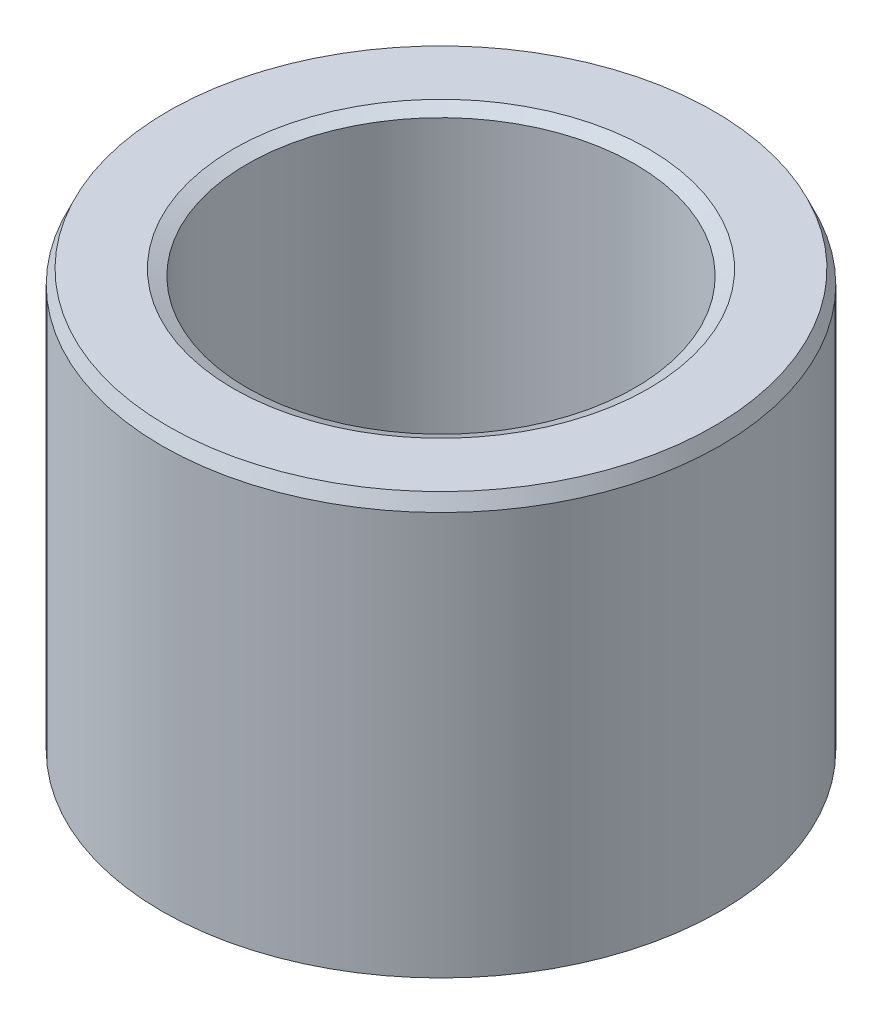
ISO-10303-21;
HEADER;
FILE_DESCRIPTION(('STEP AP214'),'2;1');
FILE_NAME('part.step','',(''),(''),'','','');
FILE_SCHEMA(('AUTOMOTIVE_DESIGN { 1 0 10303 214 1 1 1 1 }'));
ENDSEC;
DATA;
#1=APPLICATION_CONTEXT('core data for automotive mechanical design processes');
#2=APPLICATION_PROTOCOL_DEFINITION('international standard','automotive_design',2000,#1);
#3=PRODUCT_CONTEXT('',#1,'mechanical');
#4=PRODUCT('Part','Part','',(#3));
#5=PRODUCT_RELATED_PRODUCT_CATEGORY('part','',(#4));
#6=PRODUCT_DEFINITION_FORMATION('','',#4);
#7=PRODUCT_DEFINITION_CONTEXT('part definition',#1,'design');
#8=PRODUCT_DEFINITION('design','',#6,#7);
#9=PRODUCT_DEFINITION_SHAPE('','',#8);
#10=(LENGTH_UNIT() NAMED_UNIT(*) SI_UNIT(.MILLI.,.METRE.));
#11=(NAMED_UNIT(*) PLANE_ANGLE_UNIT() SI_UNIT($,.RADIAN.));
#12=(NAMED_UNIT(*) SI_UNIT($,.STERADIAN.) SOLID_ANGLE_UNIT());
#13=UNCERTAINTY_MEASURE_WITH_UNIT(LENGTH_MEASURE(1.E-05),#10,'distance_accuracy_value','');
#14=(GEOMETRIC_REPRESENTATION_CONTEXT(3) GLOBAL_UNCERTAINTY_ASSIGNED_CONTEXT((#13)) GLOBAL_UNIT_ASSIGNED_CONTEXT((#10,
#11,#12)) REPRESENTATION_CONTEXT('',''));
#15=CARTESIAN_POINT('',(0.,0.,0.));
#16=DIRECTION('',(0.,0.,1.));
#17=DIRECTION('',(1.,0.,0.));
#18=AXIS2_PLACEMENT_3D('',#15,#16,#17);
#19=CARTESIAN_POINT('',(0.,15.1544612259986,0.));
#20=DIRECTION('',(0.,-1.,0.));
#21=DIRECTION('',(0.,0.,-1.));
#22=AXIS2_PLACEMENT_3D('',#19,#20,#21);
#23=CYLINDRICAL_SURFACE('',#22,10.);
#24=CARTESIAN_POINT('',(0.,0.223008602792184,0.));
#25=DIRECTION('',(0.,1.,0.));
#26=DIRECTION('',(0.,0.,1.));
#27=AXIS2_PLACEMENT_3D('',#24,#25,#26);
#28=CIRCLE('',#27,10.);
#29=CARTESIAN_POINT('',(0.,0.223008602792184,10.));
#30=VERTEX_POINT('',#29);
#31=EDGE_CURVE('E10',#30,#30,#28,.T.);
#32=ORIENTED_EDGE('',*,*,#31,.T.);
#33=EDGE_LOOP('',(#32));
#34=FACE_BOUND('',#33,.T.);
#35=CARTESIAN_POINT('',(0.,14.6619157834008,0.));
#36=DIRECTION('',(0.,1.,0.));
#37=DIRECTION('',(0.,0.,1.));
#38=AXIS2_PLACEMENT_3D('',#35,#36,#37);
#39=CIRCLE('',#38,10.);
#40=CARTESIAN_POINT('',(0.,14.6619157834008,10.));
#41=VERTEX_POINT('',#40);
#42=EDGE_CURVE('E50',#41,#41,#39,.F.);
#43=ORIENTED_EDGE('',*,*,#42,.T.);
#44=EDGE_LOOP('',(#43));
#45=FACE_BOUND('',#44,.T.);
#46=ADVANCED_FACE('F39',(#34,#45),#23,.T.);
#47=CARTESIAN_POINT('',(0.,15.1544612259986,0.));
#48=DIRECTION('',(0.,1.,0.));
#49=DIRECTION('',(0.,0.,1.));
#50=AXIS2_PLACEMENT_3D('',#47,#48,#49);
#51=PLANE('',#50);
#52=CARTESIAN_POINT('',(0.,15.1544612259986,0.));
#53=DIRECTION('',(0.,1.,0.));
#54=DIRECTION('',(0.,0.,1.));
#55=AXIS2_PLACEMENT_3D('',#52,#53,#54);
#56=CIRCLE('',#55,7.43730472030932);
#57=CARTESIAN_POINT('',(0.,15.1544612259986,7.43730472030932));
#58=VERTEX_POINT('',#57);
#59=EDGE_CURVE('E58',#58,#58,#56,.F.);
#60=ORIENTED_EDGE('',*,*,#59,.T.);
#61=EDGE_LOOP('',(#60));
#62=FACE_BOUND('',#61,.T.);
#63=CARTESIAN_POINT('',(0.,15.1544612259986,0.));
#64=DIRECTION('',(0.,1.,0.));
#65=DIRECTION('',(0.,0.,1.));
#66=AXIS2_PLACEMENT_3D('',#63,#64,#65);
#67=CIRCLE('',#66,9.77699139720781);
#68=CARTESIAN_POINT('',(0.,15.1544612259986,9.77699139720781));
#69=VERTEX_POINT('',#68);
#70=EDGE_CURVE('E61',#69,#69,#67,.T.);
#71=ORIENTED_EDGE('',*,*,#70,.T.);
#72=EDGE_LOOP('',(#71));
#73=FACE_BOUND('',#72,.T.);
#74=ADVANCED_FACE('F88',(#62,#73),#51,.T.);
#75=CARTESIAN_POINT('',(0.,0.,0.));
#76=DIRECTION('',(0.,1.,0.));
#77=DIRECTION('',(0.,0.,1.));
#78=AXIS2_PLACEMENT_3D('',#75,#76,#77);
#79=PLANE('',#78);
#80=CARTESIAN_POINT('',(0.,0.,0.));
#81=DIRECTION('',(0.,1.,0.));
#82=DIRECTION('',(0.,0.,1.));
#83=AXIS2_PLACEMENT_3D('',#80,#81,#82);
#84=CIRCLE('',#83,7.16776788050371);
#85=CARTESIAN_POINT('',(0.,0.,7.16776788050371));
#86=VERTEX_POINT('',#85);
#87=EDGE_CURVE('E51',#86,#86,#84,.T.);
#88=ORIENTED_EDGE('',*,*,#87,.T.);
#89=EDGE_LOOP('',(#88));
#90=FACE_BOUND('',#89,.T.);
#91=CARTESIAN_POINT('',(0.,0.,0.));
#92=DIRECTION('',(0.,1.,0.));
#93=DIRECTION('',(0.,0.,1.));
#94=AXIS2_PLACEMENT_3D('',#91,#92,#93);
#95=CIRCLE('',#94,9.5074545574022);
#96=CARTESIAN_POINT('',(0.,0.,9.5074545574022));
#97=VERTEX_POINT('',#96);
#98=EDGE_CURVE('E54',#97,#97,#95,.F.);
#99=ORIENTED_EDGE('',*,*,#98,.T.);
#100=EDGE_LOOP('',(#99));
#101=FACE_BOUND('',#100,.T.);
#102=ADVANCED_FACE('F83',(#90,#101),#79,.F.);
#103=CARTESIAN_POINT('',(0.,15.1544612259986,0.));
#104=DIRECTION('',(0.,-1.,0.));
#105=DIRECTION('',(0.,0.,-1.));
#106=AXIS2_PLACEMENT_3D('',#103,#104,#105);
#107=CYLINDRICAL_SURFACE('',#106,6.94475927771152);
#108=CARTESIAN_POINT('',(0.,14.9314526232064,0.));
#109=DIRECTION('',(0.,1.,0.));
#110=DIRECTION('',(0.,0.,1.));
#111=AXIS2_PLACEMENT_3D('',#108,#109,#110);
#112=CIRCLE('',#111,6.94475927771152);
#113=CARTESIAN_POINT('',(0.,14.9314526232064,6.94475927771152));
#114=VERTEX_POINT('',#113);
#115=EDGE_CURVE('E67',#114,#114,#112,.T.);
#116=ORIENTED_EDGE('',*,*,#115,.T.);
#117=EDGE_LOOP('',(#116));
#118=FACE_BOUND('',#117,.T.);
#119=CARTESIAN_POINT('',(0.,0.492545442597801,0.));
#120=DIRECTION('',(0.,1.,0.));
#121=DIRECTION('',(0.,0.,1.));
#122=AXIS2_PLACEMENT_3D('',#119,#120,#121);
#123=CIRCLE('',#122,6.94475927771152);
#124=CARTESIAN_POINT('',(0.,0.492545442597801,6.94475927771152));
#125=VERTEX_POINT('',#124);
#126=EDGE_CURVE('E69',#125,#125,#123,.F.);
#127=ORIENTED_EDGE('',*,*,#126,.T.);
#128=EDGE_LOOP('',(#127));
#129=FACE_BOUND('',#128,.T.);
#130=ADVANCED_FACE('F71',(#118,#129),#107,.F.);
#131=CARTESIAN_POINT('',(0.,14.9314526232064,0.));
#132=DIRECTION('',(0.,1.,0.));
#133=DIRECTION('',(0.,0.,1.));
#134=AXIS2_PLACEMENT_3D('',#131,#132,#133);
#135=CONICAL_SURFACE('',#134,6.94475927771152,1.1456432729864);
#136=ORIENTED_EDGE('',*,*,#59,.F.);
#137=EDGE_LOOP('',(#136));
#138=FACE_BOUND('',#137,.T.);
#139=ORIENTED_EDGE('',*,*,#115,.F.);
#140=EDGE_LOOP('',(#139));
#141=FACE_BOUND('',#140,.T.);
#142=ADVANCED_FACE('F77',(#138,#141),#135,.F.);
#143=CARTESIAN_POINT('',(0.,0.,0.));
#144=DIRECTION('',(0.,-1.,0.));
#145=DIRECTION('',(0.,0.,-1.));
#146=AXIS2_PLACEMENT_3D('',#143,#144,#145);
#147=CONICAL_SURFACE('',#146,7.16776788050371,0.425153053808501);
#148=ORIENTED_EDGE('',*,*,#126,.F.);
#149=EDGE_LOOP('',(#148));
#150=FACE_BOUND('',#149,.T.);
#151=ORIENTED_EDGE('',*,*,#87,.F.);
#152=EDGE_LOOP('',(#151));
#153=FACE_BOUND('',#152,.T.);
#154=ADVANCED_FACE('F73',(#150,#153),#147,.F.);
#155=CARTESIAN_POINT('',(0.,0.223008602792184,0.));
#156=DIRECTION('',(0.,1.,0.));
#157=DIRECTION('',(0.,0.,1.));
#158=AXIS2_PLACEMENT_3D('',#155,#156,#157);
#159=CONICAL_SURFACE('',#158,10.,1.1456432729864);
#160=CARTESIAN_POINT('',(0.,0.,9.5074545574022));
#161=CARTESIAN_POINT('',(0.,0.00232300627908523,9.51258523909593));
#162=CARTESIAN_POINT('',(0.,0.00464601255817048,9.51771592078965));
#163=CARTESIAN_POINT('',(0.,0.00929202511634099,9.52797728417711));
#164=CARTESIAN_POINT('',(0.,0.0116150313954262,9.53310796587084));
#165=CARTESIAN_POINT('',(0.,0.0162610439535968,9.54336932925829));
#166=CARTESIAN_POINT('',(0.,0.018584050232682,9.54850001095202));
#167=CARTESIAN_POINT('',(0.,0.0232300627908525,9.55876137433947));
#168=CARTESIAN_POINT('',(0.,0.0255530690699378,9.5638920560332));
#169=CARTESIAN_POINT('',(0.,0.0301990816281083,9.57415341942065));
#170=CARTESIAN_POINT('',(0.,0.0325220879071935,9.57928410111438));
#171=CARTESIAN_POINT('',(0.,0.037168100465364,9.58954546450183));
#172=CARTESIAN_POINT('',(0.,0.0394911067444493,9.59467614619556));
#173=CARTESIAN_POINT('',(0.,0.0441371193026198,9.60493750958301));
#174=CARTESIAN_POINT('',(0.,0.0464601255817051,9.61006819127674));
#175=CARTESIAN_POINT('',(0.,0.0511061381398756,9.6203295546642));
#176=CARTESIAN_POINT('',(0.,0.0534291444189608,9.62546023635792));
#177=CARTESIAN_POINT('',(0.,0.0580751569771313,9.63572159974538));
#178=CARTESIAN_POINT('',(0.,0.0603981632562166,9.64085228143911));
#179=CARTESIAN_POINT('',(0.,0.0650441758143871,9.65111364482656));
#180=CARTESIAN_POINT('',(0.,0.0673671820934724,9.65624432652029));
#181=CARTESIAN_POINT('',(0.,0.0720131946516429,9.66650568990774));
#182=CARTESIAN_POINT('',(0.,0.0743362009307281,9.67163637160147));
#183=CARTESIAN_POINT('',(0.,0.0789822134888986,9.68189773498892));
#184=CARTESIAN_POINT('',(0.,0.0813052197679839,9.68702841668265));
#185=CARTESIAN_POINT('',(0.,0.0859512323261544,9.6972897800701));
#186=CARTESIAN_POINT('',(0.,0.0882742386052397,9.70242046176383));
#187=CARTESIAN_POINT('',(0.,0.0929202511634102,9.71268182515128));
#188=CARTESIAN_POINT('',(0.,0.0952432574424954,9.71781250684501));
#189=CARTESIAN_POINT('',(0.,0.099889270000666,9.72807387023246));
#190=CARTESIAN_POINT('',(0.,0.102212276279751,9.73320455192619));
#191=CARTESIAN_POINT('',(0.,0.106858288837922,9.74346591531365));
#192=CARTESIAN_POINT('',(0.,0.109181295117007,9.74859659700737));
#193=CARTESIAN_POINT('',(0.,0.113827307675177,9.75885796039483));
#194=CARTESIAN_POINT('',(0.,0.116150313954263,9.76398864208856));
#195=CARTESIAN_POINT('',(0.,0.120796326512433,9.77425000547601));
#196=CARTESIAN_POINT('',(0.,0.123119332791519,9.77938068716974));
#197=CARTESIAN_POINT('',(0.,0.127765345349689,9.78964205055719));
#198=CARTESIAN_POINT('',(0.,0.130088351628774,9.79477273225092));
#199=CARTESIAN_POINT('',(0.,0.134734364186945,9.80503409563837));
#200=CARTESIAN_POINT('',(0.,0.13705737046603,9.8101647773321));
#201=CARTESIAN_POINT('',(0.,0.141703383024201,9.82042614071955));
#202=CARTESIAN_POINT('',(0.,0.144026389303286,9.82555682241328));
#203=CARTESIAN_POINT('',(0.,0.148672401861456,9.83581818580073));
#204=CARTESIAN_POINT('',(0.,0.150995408140542,9.84094886749446));
#205=CARTESIAN_POINT('',(0.,0.155641420698712,9.85121023088191));
#206=CARTESIAN_POINT('',(0.,0.157964426977797,9.85634091257564));
#207=CARTESIAN_POINT('',(0.,0.162610439535968,9.8666022759631));
#208=CARTESIAN_POINT('',(0.,0.164933445815053,9.87173295765682));
#209=CARTESIAN_POINT('',(0.,0.169579458373224,9.88199432104428));
#210=CARTESIAN_POINT('',(0.,0.171902464652309,9.88712500273801));
#211=CARTESIAN_POINT('',(0.,0.176548477210479,9.89738636612546));
#212=CARTESIAN_POINT('',(0.,0.178871483489565,9.90251704781919));
#213=CARTESIAN_POINT('',(0.,0.183517496047735,9.91277841120664));
#214=CARTESIAN_POINT('',(0.,0.18584050232682,9.91790909290037));
#215=CARTESIAN_POINT('',(0.,0.190486514884991,9.92817045628782));
#216=CARTESIAN_POINT('',(0.,0.192809521164076,9.93330113798155));
#217=CARTESIAN_POINT('',(0.,0.197455533722247,9.943562501369));
#218=CARTESIAN_POINT('',(0.,0.199778540001332,9.94869318306273));
#219=CARTESIAN_POINT('',(0.,0.204424552559502,9.95895454645018));
#220=CARTESIAN_POINT('',(0.,0.206747558838588,9.96408522814391));
#221=CARTESIAN_POINT('',(0.,0.211393571396758,9.97434659153136));
#222=CARTESIAN_POINT('',(0.,0.213716577675843,9.97947727322509));
#223=CARTESIAN_POINT('',(0.,0.218362590234014,9.98973863661255));
#224=CARTESIAN_POINT('',(0.,0.220685596513099,9.99486931830628));
#225=CARTESIAN_POINT('',(0.,0.223008602792184,10.));
#226=B_SPLINE_CURVE_WITH_KNOTS('',3,(#160,#161,#162,#163,#164,#165,#166,#167,#168,#169,#170,
#171,#172,#173,#174,#175,#176,#177,#178,#179,#180,#181,#182,#183,#184,#185,#186,#187,#188,#189,
#190,#191,#192,#193,#194,#195,#196,#197,#198,#199,#200,#201,#202,#203,#204,#205,#206,#207,#208,
#209,#210,#211,#212,#213,#214,#215,#216,#217,#218,#219,#220,#221,#222,#223,#224,#225),
.UNSPECIFIED.,.F.,.F.,(4,2,2,2,2,2,2,2,2,2,2,2,2,2,2,2,2,2,2,2,2,2,2,2,2,2,2,2,2,2,2,2,4),(0.,
0.0168962207411937,0.0337924414823874,0.0506886622235811,0.0675848829647748,0.0844811037059685,
0.101377324447162,0.118273545188356,0.13516976592955,0.152065986670743,0.168962207411937,
0.185858428153131,0.202754648894324,0.219650869635518,0.236547090376712,0.253443311117905,
0.270339531859099,0.287235752600293,0.304131973341486,0.32102819408268,0.337924414823874,
0.354820635565068,0.371716856306261,0.388613077047455,0.405509297788649,0.422405518529842,
0.439301739271036,0.45619796001223,0.473094180753423,0.489990401494617,0.506886622235811,
0.523782842977005,0.540679063718198),.UNSPECIFIED.);
#227=EDGE_CURVE('BSEAM76',#97,#30,#226,.T.);
#228=ORIENTED_EDGE('',*,*,#98,.F.);
#229=ORIENTED_EDGE('',*,*,#31,.F.);
#230=ORIENTED_EDGE('',*,*,#227,.T.);
#231=ORIENTED_EDGE('',*,*,#227,.F.);
#232=EDGE_LOOP('',(#228,#230,#229,#231));
#233=FACE_BOUND('',#232,.T.);
#234=ADVANCED_FACE('F76',(#233),#159,.T.);
#235=CARTESIAN_POINT('',(0.,15.1544612259986,0.));
#236=DIRECTION('',(0.,-1.,0.));
#237=DIRECTION('',(0.,0.,-1.));
#238=AXIS2_PLACEMENT_3D('',#235,#236,#237);
#239=CONICAL_SURFACE('',#238,9.77699139720781,0.4251530538085);
#240=ORIENTED_EDGE('',*,*,#42,.F.);
#241=EDGE_LOOP('',(#240));
#242=FACE_BOUND('',#241,.T.);
#243=ORIENTED_EDGE('',*,*,#70,.F.);
#244=EDGE_LOOP('',(#243));
#245=FACE_BOUND('',#244,.T.);
#246=ADVANCED_FACE('F45',(#242,#245),#239,.T.);
#247=CLOSED_SHELL('',(#46,#74,#102,#130,#142,#154,#234,#246));
#248=MANIFOLD_SOLID_BREP('B2',#247);
#249=ADVANCED_BREP_SHAPE_REPRESENTATION('',(#18,#248),#14);
#250=SHAPE_DEFINITION_REPRESENTATION(#9,#249);
ENDSEC;
END-ISO-10303-21;
